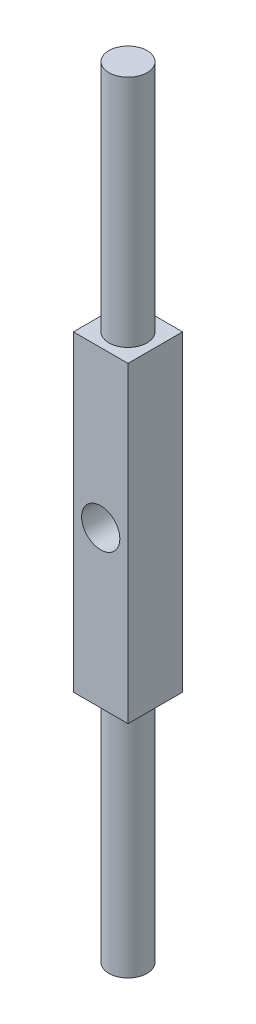
ISO-10303-21;
HEADER;
FILE_DESCRIPTION(('STEP AP214'),'2;1');
FILE_NAME('part.step','',(''),(''),'','','');
FILE_SCHEMA(('AUTOMOTIVE_DESIGN { 1 0 10303 214 1 1 1 1 }'));
ENDSEC;
DATA;
#1=APPLICATION_CONTEXT('core data for automotive mechanical design processes');
#2=APPLICATION_PROTOCOL_DEFINITION('international standard','automotive_design',2000,#1);
#3=PRODUCT_CONTEXT('',#1,'mechanical');
#4=PRODUCT('Part','Part','',(#3));
#5=PRODUCT_RELATED_PRODUCT_CATEGORY('part','',(#4));
#6=PRODUCT_DEFINITION_FORMATION('','',#4);
#7=PRODUCT_DEFINITION_CONTEXT('part definition',#1,'design');
#8=PRODUCT_DEFINITION('design','',#6,#7);
#9=PRODUCT_DEFINITION_SHAPE('','',#8);
#10=(LENGTH_UNIT() NAMED_UNIT(*) SI_UNIT(.MILLI.,.METRE.));
#11=(NAMED_UNIT(*) PLANE_ANGLE_UNIT() SI_UNIT($,.RADIAN.));
#12=(NAMED_UNIT(*) SI_UNIT($,.STERADIAN.) SOLID_ANGLE_UNIT());
#13=UNCERTAINTY_MEASURE_WITH_UNIT(LENGTH_MEASURE(1.E-05),#10,'distance_accuracy_value','');
#14=(GEOMETRIC_REPRESENTATION_CONTEXT(3) GLOBAL_UNCERTAINTY_ASSIGNED_CONTEXT((#13)) GLOBAL_UNIT_ASSIGNED_CONTEXT((#10,
#11,#12)) REPRESENTATION_CONTEXT('',''));
#15=CARTESIAN_POINT('',(0.,0.,0.));
#16=DIRECTION('',(0.,0.,1.));
#17=DIRECTION('',(1.,0.,0.));
#18=AXIS2_PLACEMENT_3D('',#15,#16,#17);
#19=CARTESIAN_POINT('',(0.,50.,0.));
#20=DIRECTION('',(0.,-1.,0.));
#21=DIRECTION('',(0.,0.,-1.));
#22=AXIS2_PLACEMENT_3D('',#19,#20,#21);
#23=CYLINDRICAL_SURFACE('',#22,2.45);
#24=CARTESIAN_POINT('',(0.,20.,0.));
#25=DIRECTION('',(0.,1.,0.));
#26=DIRECTION('',(0.,0.,1.));
#27=AXIS2_PLACEMENT_3D('',#24,#25,#26);
#28=CIRCLE('',#27,2.45);
#29=CARTESIAN_POINT('',(0.,20.,2.45));
#30=VERTEX_POINT('',#29);
#31=EDGE_CURVE('E81',#30,#30,#28,.T.);
#32=ORIENTED_EDGE('',*,*,#31,.T.);
#33=EDGE_LOOP('',(#32));
#34=FACE_BOUND('',#33,.T.);
#35=CARTESIAN_POINT('',(0.,50.,0.));
#36=DIRECTION('',(0.,1.,0.));
#37=DIRECTION('',(0.,0.,1.));
#38=AXIS2_PLACEMENT_3D('',#35,#36,#37);
#39=CIRCLE('',#38,2.45);
#40=CARTESIAN_POINT('',(0.,50.,2.45));
#41=VERTEX_POINT('',#40);
#42=EDGE_CURVE('E39',#41,#41,#39,.T.);
#43=ORIENTED_EDGE('',*,*,#42,.F.);
#44=EDGE_LOOP('',(#43));
#45=FACE_BOUND('',#44,.T.);
#46=ADVANCED_FACE('F32',(#34,#45),#23,.T.);
#47=CARTESIAN_POINT('',(0.,50.,0.));
#48=DIRECTION('',(0.,1.,0.));
#49=DIRECTION('',(0.,0.,1.));
#50=AXIS2_PLACEMENT_3D('',#47,#48,#49);
#51=PLANE('',#50);
#52=ORIENTED_EDGE('',*,*,#42,.T.);
#53=EDGE_LOOP('',(#52));
#54=FACE_BOUND('',#53,.T.);
#55=ADVANCED_FACE('F127',(#54),#51,.T.);
#56=CARTESIAN_POINT('',(0.,20.,0.));
#57=DIRECTION('',(0.,1.,0.));
#58=DIRECTION('',(0.,0.,1.));
#59=AXIS2_PLACEMENT_3D('',#56,#57,#58);
#60=PLANE('',#59);
#61=DIRECTION('',(0.,0.,-1.));
#62=VECTOR('',#61,1.);
#63=CARTESIAN_POINT('',(3.5,20.,-3.5));
#64=LINE('',#63,#62);
#65=CARTESIAN_POINT('',(3.5,20.,3.5));
#66=VERTEX_POINT('',#65);
#67=CARTESIAN_POINT('',(3.5,20.,-3.5));
#68=VERTEX_POINT('',#67);
#69=EDGE_CURVE('E107',#66,#68,#64,.T.);
#70=ORIENTED_EDGE('',*,*,#69,.T.);
#71=DIRECTION('',(-1.,0.,0.));
#72=VECTOR('',#71,1.);
#73=CARTESIAN_POINT('',(-3.5,20.,-3.5));
#74=LINE('',#73,#72);
#75=CARTESIAN_POINT('',(-3.5,20.,-3.5));
#76=VERTEX_POINT('',#75);
#77=EDGE_CURVE('E77',#68,#76,#74,.T.);
#78=ORIENTED_EDGE('',*,*,#77,.T.);
#79=DIRECTION('',(0.,0.,1.));
#80=VECTOR('',#79,1.);
#81=CARTESIAN_POINT('',(-3.5,20.,-3.5));
#82=LINE('',#81,#80);
#83=CARTESIAN_POINT('',(-3.5,20.,3.5));
#84=VERTEX_POINT('',#83);
#85=EDGE_CURVE('E51',#76,#84,#82,.T.);
#86=ORIENTED_EDGE('',*,*,#85,.T.);
#87=DIRECTION('',(1.,0.,0.));
#88=VECTOR('',#87,1.);
#89=CARTESIAN_POINT('',(-3.5,20.,3.5));
#90=LINE('',#89,#88);
#91=EDGE_CURVE('E46',#84,#66,#90,.T.);
#92=ORIENTED_EDGE('',*,*,#91,.T.);
#93=EDGE_LOOP('',(#70,#78,#86,#92));
#94=FACE_BOUND('',#93,.T.);
#95=ORIENTED_EDGE('',*,*,#31,.F.);
#96=EDGE_LOOP('',(#95));
#97=FACE_BOUND('',#96,.T.);
#98=ADVANCED_FACE('F125',(#94,#97),#60,.T.);
#99=CARTESIAN_POINT('',(3.5,20.,-3.5));
#100=DIRECTION('',(-1.,0.,0.));
#101=DIRECTION('',(0.,0.,1.));
#102=AXIS2_PLACEMENT_3D('',#99,#100,#101);
#103=PLANE('',#102);
#104=DIRECTION('',(0.,-1.,0.));
#105=VECTOR('',#104,1.);
#106=CARTESIAN_POINT('',(3.5,20.,3.5));
#107=LINE('',#106,#105);
#108=CARTESIAN_POINT('',(3.5,-20.,3.5));
#109=VERTEX_POINT('',#108);
#110=EDGE_CURVE('E96',#66,#109,#107,.T.);
#111=ORIENTED_EDGE('',*,*,#110,.T.);
#112=DIRECTION('',(0.,0.,-1.));
#113=VECTOR('',#112,1.);
#114=CARTESIAN_POINT('',(3.5,-20.,-3.5));
#115=LINE('',#114,#113);
#116=CARTESIAN_POINT('',(3.5,-20.,-3.5));
#117=VERTEX_POINT('',#116);
#118=EDGE_CURVE('E90',#109,#117,#115,.T.);
#119=ORIENTED_EDGE('',*,*,#118,.T.);
#120=DIRECTION('',(0.,-1.,0.));
#121=VECTOR('',#120,1.);
#122=CARTESIAN_POINT('',(3.5,20.,-3.5));
#123=LINE('',#122,#121);
#124=EDGE_CURVE('E72',#68,#117,#123,.T.);
#125=ORIENTED_EDGE('',*,*,#124,.F.);
#126=ORIENTED_EDGE('',*,*,#69,.F.);
#127=EDGE_LOOP('',(#111,#119,#125,#126));
#128=FACE_BOUND('',#127,.T.);
#129=ADVANCED_FACE('F95',(#128),#103,.F.);
#130=CARTESIAN_POINT('',(-3.5,20.,-3.5));
#131=DIRECTION('',(0.,0.,1.));
#132=DIRECTION('',(1.,0.,0.));
#133=AXIS2_PLACEMENT_3D('',#130,#131,#132);
#134=PLANE('',#133);
#135=CARTESIAN_POINT('',(0.,0.,-3.5));
#136=DIRECTION('',(0.,0.,1.));
#137=DIRECTION('',(1.,0.,0.));
#138=AXIS2_PLACEMENT_3D('',#135,#136,#137);
#139=CIRCLE('',#138,2.45);
#140=CARTESIAN_POINT('',(2.45,0.,-3.5));
#141=VERTEX_POINT('',#140);
#142=EDGE_CURVE('E97',#141,#141,#139,.T.);
#143=ORIENTED_EDGE('',*,*,#142,.T.);
#144=EDGE_LOOP('',(#143));
#145=FACE_BOUND('',#144,.T.);
#146=ORIENTED_EDGE('',*,*,#124,.T.);
#147=DIRECTION('',(-1.,0.,0.));
#148=VECTOR('',#147,1.);
#149=CARTESIAN_POINT('',(-3.5,-20.,-3.5));
#150=LINE('',#149,#148);
#151=CARTESIAN_POINT('',(-3.5,-20.,-3.5));
#152=VERTEX_POINT('',#151);
#153=EDGE_CURVE('E76',#117,#152,#150,.T.);
#154=ORIENTED_EDGE('',*,*,#153,.T.);
#155=DIRECTION('',(0.,-1.,0.));
#156=VECTOR('',#155,1.);
#157=CARTESIAN_POINT('',(-3.5,20.,-3.5));
#158=LINE('',#157,#156);
#159=EDGE_CURVE('E82',#76,#152,#158,.T.);
#160=ORIENTED_EDGE('',*,*,#159,.F.);
#161=ORIENTED_EDGE('',*,*,#77,.F.);
#162=EDGE_LOOP('',(#146,#154,#160,#161));
#163=FACE_BOUND('',#162,.T.);
#164=ADVANCED_FACE('F74',(#145,#163),#134,.F.);
#165=CARTESIAN_POINT('',(-3.5,20.,-3.5));
#166=DIRECTION('',(1.,0.,0.));
#167=DIRECTION('',(0.,0.,-1.));
#168=AXIS2_PLACEMENT_3D('',#165,#166,#167);
#169=PLANE('',#168);
#170=ORIENTED_EDGE('',*,*,#159,.T.);
#171=DIRECTION('',(0.,0.,1.));
#172=VECTOR('',#171,1.);
#173=CARTESIAN_POINT('',(-3.5,-20.,-3.5));
#174=LINE('',#173,#172);
#175=CARTESIAN_POINT('',(-3.5,-20.,3.5));
#176=VERTEX_POINT('',#175);
#177=EDGE_CURVE('E93',#152,#176,#174,.T.);
#178=ORIENTED_EDGE('',*,*,#177,.T.);
#179=DIRECTION('',(0.,-1.,0.));
#180=VECTOR('',#179,1.);
#181=CARTESIAN_POINT('',(-3.5,20.,3.5));
#182=LINE('',#181,#180);
#183=EDGE_CURVE('E113',#84,#176,#182,.T.);
#184=ORIENTED_EDGE('',*,*,#183,.F.);
#185=ORIENTED_EDGE('',*,*,#85,.F.);
#186=EDGE_LOOP('',(#170,#178,#184,#185));
#187=FACE_BOUND('',#186,.T.);
#188=ADVANCED_FACE('F161',(#187),#169,.F.);
#189=CARTESIAN_POINT('',(-3.5,20.,3.5));
#190=DIRECTION('',(0.,0.,-1.));
#191=DIRECTION('',(-1.,0.,0.));
#192=AXIS2_PLACEMENT_3D('',#189,#190,#191);
#193=PLANE('',#192);
#194=CARTESIAN_POINT('',(0.,0.,3.5));
#195=DIRECTION('',(0.,0.,1.));
#196=DIRECTION('',(1.,0.,0.));
#197=AXIS2_PLACEMENT_3D('',#194,#195,#196);
#198=CIRCLE('',#197,2.45);
#199=CARTESIAN_POINT('',(2.45,0.,3.5));
#200=VERTEX_POINT('',#199);
#201=EDGE_CURVE('E100',#200,#200,#198,.T.);
#202=ORIENTED_EDGE('',*,*,#201,.F.);
#203=EDGE_LOOP('',(#202));
#204=FACE_BOUND('',#203,.T.);
#205=ORIENTED_EDGE('',*,*,#183,.T.);
#206=DIRECTION('',(1.,0.,0.));
#207=VECTOR('',#206,1.);
#208=CARTESIAN_POINT('',(-3.5,-20.,3.5));
#209=LINE('',#208,#207);
#210=EDGE_CURVE('E105',#176,#109,#209,.T.);
#211=ORIENTED_EDGE('',*,*,#210,.T.);
#212=ORIENTED_EDGE('',*,*,#110,.F.);
#213=ORIENTED_EDGE('',*,*,#91,.F.);
#214=EDGE_LOOP('',(#205,#211,#212,#213));
#215=FACE_BOUND('',#214,.T.);
#216=ADVANCED_FACE('F157',(#204,#215),#193,.F.);
#217=CARTESIAN_POINT('',(0.,-20.,0.));
#218=DIRECTION('',(0.,1.,0.));
#219=DIRECTION('',(0.,0.,1.));
#220=AXIS2_PLACEMENT_3D('',#217,#218,#219);
#221=PLANE('',#220);
#222=ORIENTED_EDGE('',*,*,#118,.F.);
#223=ORIENTED_EDGE('',*,*,#210,.F.);
#224=ORIENTED_EDGE('',*,*,#177,.F.);
#225=ORIENTED_EDGE('',*,*,#153,.F.);
#226=EDGE_LOOP('',(#222,#223,#224,#225));
#227=FACE_BOUND('',#226,.T.);
#228=CARTESIAN_POINT('',(0.,-20.,0.));
#229=DIRECTION('',(0.,1.,0.));
#230=DIRECTION('',(0.,0.,1.));
#231=AXIS2_PLACEMENT_3D('',#228,#229,#230);
#232=CIRCLE('',#231,2.45);
#233=CARTESIAN_POINT('',(0.,-20.,2.45));
#234=VERTEX_POINT('',#233);
#235=EDGE_CURVE('E11',#234,#234,#232,.T.);
#236=ORIENTED_EDGE('',*,*,#235,.T.);
#237=EDGE_LOOP('',(#236));
#238=FACE_BOUND('',#237,.T.);
#239=ADVANCED_FACE('F87',(#227,#238),#221,.F.);
#240=CARTESIAN_POINT('',(0.,-50.,0.));
#241=DIRECTION('',(0.,1.,0.));
#242=DIRECTION('',(0.,0.,1.));
#243=AXIS2_PLACEMENT_3D('',#240,#241,#242);
#244=PLANE('',#243);
#245=CARTESIAN_POINT('',(0.,-50.,0.));
#246=DIRECTION('',(0.,1.,0.));
#247=DIRECTION('',(0.,0.,1.));
#248=AXIS2_PLACEMENT_3D('',#245,#246,#247);
#249=CIRCLE('',#248,2.45);
#250=CARTESIAN_POINT('',(0.,-50.,2.45));
#251=VERTEX_POINT('',#250);
#252=EDGE_CURVE('E116',#251,#251,#249,.T.);
#253=ORIENTED_EDGE('',*,*,#252,.F.);
#254=EDGE_LOOP('',(#253));
#255=FACE_BOUND('',#254,.T.);
#256=ADVANCED_FACE('F143',(#255),#244,.F.);
#257=ORIENTED_EDGE('',*,*,#252,.T.);
#258=EDGE_LOOP('',(#257));
#259=FACE_BOUND('',#258,.T.);
#260=ORIENTED_EDGE('',*,*,#235,.F.);
#261=EDGE_LOOP('',(#260));
#262=FACE_BOUND('',#261,.T.);
#263=ADVANCED_FACE('F138',(#259,#262),#23,.T.);
#264=CARTESIAN_POINT('',(0.,0.,-3.5));
#265=DIRECTION('',(0.,0.,1.));
#266=DIRECTION('',(1.,0.,0.));
#267=AXIS2_PLACEMENT_3D('',#264,#265,#266);
#268=CYLINDRICAL_SURFACE('',#267,2.45);
#269=ORIENTED_EDGE('',*,*,#142,.F.);
#270=EDGE_LOOP('',(#269));
#271=FACE_BOUND('',#270,.T.);
#272=ORIENTED_EDGE('',*,*,#201,.T.);
#273=EDGE_LOOP('',(#272));
#274=FACE_BOUND('',#273,.T.);
#275=ADVANCED_FACE('F142',(#271,#274),#268,.F.);
#276=CLOSED_SHELL('',(#46,#55,#98,#129,#164,#188,#216,#239,#256,#263,#275));
#277=MANIFOLD_SOLID_BREP('B2',#276);
#278=ADVANCED_BREP_SHAPE_REPRESENTATION('',(#18,#277),#14);
#279=SHAPE_DEFINITION_REPRESENTATION(#9,#278);
ENDSEC;
END-ISO-10303-21;
